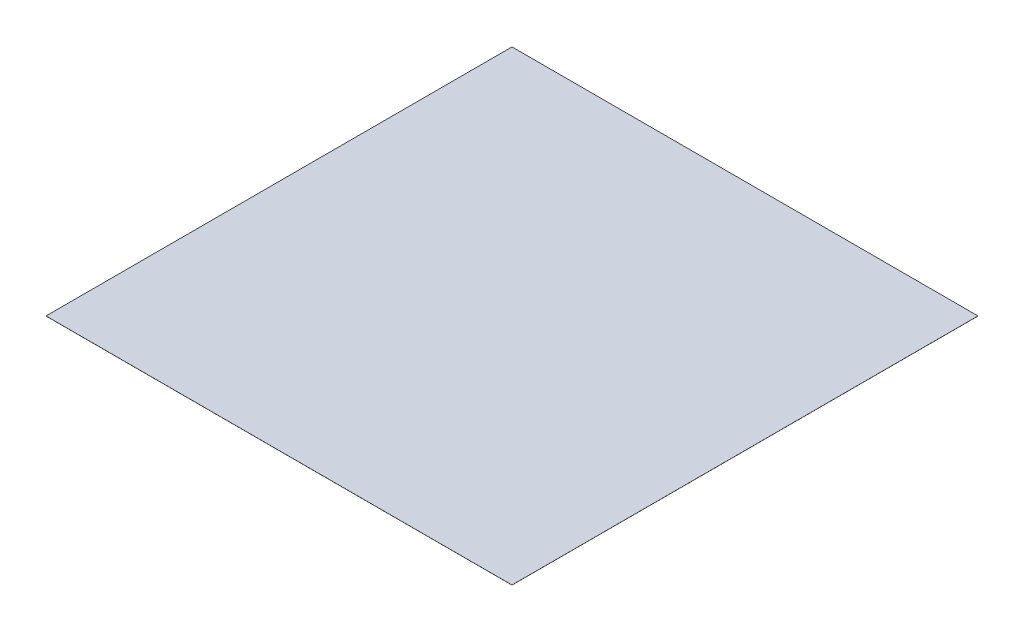
ISO-10303-21;
HEADER;
FILE_DESCRIPTION(('STEP AP214'),'2;1');
FILE_NAME('part.step','',(''),(''),'','','');
FILE_SCHEMA(('AUTOMOTIVE_DESIGN { 1 0 10303 214 1 1 1 1 }'));
ENDSEC;
DATA;
#1=APPLICATION_CONTEXT('core data for automotive mechanical design processes');
#2=APPLICATION_PROTOCOL_DEFINITION('international standard','automotive_design',2000,#1);
#3=PRODUCT_CONTEXT('',#1,'mechanical');
#4=PRODUCT('Part','Part','',(#3));
#5=PRODUCT_RELATED_PRODUCT_CATEGORY('part','',(#4));
#6=PRODUCT_DEFINITION_FORMATION('','',#4);
#7=PRODUCT_DEFINITION_CONTEXT('part definition',#1,'design');
#8=PRODUCT_DEFINITION('design','',#6,#7);
#9=PRODUCT_DEFINITION_SHAPE('','',#8);
#10=(LENGTH_UNIT() NAMED_UNIT(*) SI_UNIT(.MILLI.,.METRE.));
#11=(NAMED_UNIT(*) PLANE_ANGLE_UNIT() SI_UNIT($,.RADIAN.));
#12=(NAMED_UNIT(*) SI_UNIT($,.STERADIAN.) SOLID_ANGLE_UNIT());
#13=UNCERTAINTY_MEASURE_WITH_UNIT(LENGTH_MEASURE(1.E-05),#10,'distance_accuracy_value','');
#14=(GEOMETRIC_REPRESENTATION_CONTEXT(3) GLOBAL_UNCERTAINTY_ASSIGNED_CONTEXT((#13)) GLOBAL_UNIT_ASSIGNED_CONTEXT((#10,
#11,#12)) REPRESENTATION_CONTEXT('',''));
#15=CARTESIAN_POINT('',(0.,0.,0.));
#16=DIRECTION('',(0.,0.,1.));
#17=DIRECTION('',(1.,0.,0.));
#18=AXIS2_PLACEMENT_3D('',#15,#16,#17);
#19=CARTESIAN_POINT('',(0.,10.,0.));
#20=DIRECTION('',(1.,0.,0.));
#21=DIRECTION('',(0.,0.,-1.));
#22=AXIS2_PLACEMENT_3D('',#19,#20,#21);
#23=PLANE('',#22);
#24=DIRECTION('',(0.,0.,1.));
#25=VECTOR('',#24,1.);
#26=CARTESIAN_POINT('',(0.,0.,0.));
#27=LINE('',#26,#25);
#28=CARTESIAN_POINT('',(0.,0.,-50000.));
#29=VERTEX_POINT('',#28);
#30=CARTESIAN_POINT('',(0.,0.,0.));
#31=VERTEX_POINT('',#30);
#32=EDGE_CURVE('E99',#29,#31,#27,.T.);
#33=ORIENTED_EDGE('',*,*,#32,.T.);
#34=DIRECTION('',(0.,-1.,0.));
#35=VECTOR('',#34,1.);
#36=CARTESIAN_POINT('',(0.,10.,0.));
#37=LINE('',#36,#35);
#38=CARTESIAN_POINT('',(0.,10.,0.));
#39=VERTEX_POINT('',#38);
#40=EDGE_CURVE('E11',#39,#31,#37,.T.);
#41=ORIENTED_EDGE('',*,*,#40,.F.);
#42=DIRECTION('',(0.,0.,1.));
#43=VECTOR('',#42,1.);
#44=CARTESIAN_POINT('',(0.,10.,0.));
#45=LINE('',#44,#43);
#46=CARTESIAN_POINT('',(0.,10.,-50000.));
#47=VERTEX_POINT('',#46);
#48=EDGE_CURVE('E87',#47,#39,#45,.T.);
#49=ORIENTED_EDGE('',*,*,#48,.F.);
#50=DIRECTION('',(0.,-1.,0.));
#51=VECTOR('',#50,1.);
#52=CARTESIAN_POINT('',(0.,10.,-50000.));
#53=LINE('',#52,#51);
#54=EDGE_CURVE('E95',#47,#29,#53,.T.);
#55=ORIENTED_EDGE('',*,*,#54,.T.);
#56=EDGE_LOOP('',(#33,#41,#49,#55));
#57=FACE_BOUND('',#56,.T.);
#58=ADVANCED_FACE('F36',(#57),#23,.F.);
#59=CARTESIAN_POINT('',(0.,10.,0.));
#60=DIRECTION('',(0.,0.,-1.));
#61=DIRECTION('',(-1.,0.,0.));
#62=AXIS2_PLACEMENT_3D('',#59,#60,#61);
#63=PLANE('',#62);
#64=DIRECTION('',(1.,0.,0.));
#65=VECTOR('',#64,1.);
#66=CARTESIAN_POINT('',(0.,0.,0.));
#67=LINE('',#66,#65);
#68=CARTESIAN_POINT('',(50000.,0.,0.));
#69=VERTEX_POINT('',#68);
#70=EDGE_CURVE('E91',#31,#69,#67,.T.);
#71=ORIENTED_EDGE('',*,*,#70,.T.);
#72=DIRECTION('',(0.,-1.,0.));
#73=VECTOR('',#72,1.);
#74=CARTESIAN_POINT('',(50000.,10.,0.));
#75=LINE('',#74,#73);
#76=CARTESIAN_POINT('',(50000.,10.,0.));
#77=VERTEX_POINT('',#76);
#78=EDGE_CURVE('E44',#77,#69,#75,.T.);
#79=ORIENTED_EDGE('',*,*,#78,.F.);
#80=DIRECTION('',(1.,0.,0.));
#81=VECTOR('',#80,1.);
#82=CARTESIAN_POINT('',(0.,10.,0.));
#83=LINE('',#82,#81);
#84=EDGE_CURVE('E82',#39,#77,#83,.T.);
#85=ORIENTED_EDGE('',*,*,#84,.F.);
#86=ORIENTED_EDGE('',*,*,#40,.T.);
#87=EDGE_LOOP('',(#71,#79,#85,#86));
#88=FACE_BOUND('',#87,.T.);
#89=ADVANCED_FACE('F90',(#88),#63,.F.);
#90=CARTESIAN_POINT('',(50000.,10.,0.));
#91=DIRECTION('',(-1.,0.,0.));
#92=DIRECTION('',(0.,0.,1.));
#93=AXIS2_PLACEMENT_3D('',#90,#91,#92);
#94=PLANE('',#93);
#95=DIRECTION('',(0.,0.,-1.));
#96=VECTOR('',#95,1.);
#97=CARTESIAN_POINT('',(50000.,0.,0.));
#98=LINE('',#97,#96);
#99=CARTESIAN_POINT('',(50000.,0.,-50000.));
#100=VERTEX_POINT('',#99);
#101=EDGE_CURVE('E69',#69,#100,#98,.T.);
#102=ORIENTED_EDGE('',*,*,#101,.T.);
#103=DIRECTION('',(0.,-1.,0.));
#104=VECTOR('',#103,1.);
#105=CARTESIAN_POINT('',(50000.,10.,-50000.));
#106=LINE('',#105,#104);
#107=CARTESIAN_POINT('',(50000.,10.,-50000.));
#108=VERTEX_POINT('',#107);
#109=EDGE_CURVE('E92',#108,#100,#106,.T.);
#110=ORIENTED_EDGE('',*,*,#109,.F.);
#111=DIRECTION('',(0.,0.,-1.));
#112=VECTOR('',#111,1.);
#113=CARTESIAN_POINT('',(50000.,10.,0.));
#114=LINE('',#113,#112);
#115=EDGE_CURVE('E85',#77,#108,#114,.T.);
#116=ORIENTED_EDGE('',*,*,#115,.F.);
#117=ORIENTED_EDGE('',*,*,#78,.T.);
#118=EDGE_LOOP('',(#102,#110,#116,#117));
#119=FACE_BOUND('',#118,.T.);
#120=ADVANCED_FACE('F93',(#119),#94,.F.);
#121=CARTESIAN_POINT('',(0.,10.,-50000.));
#122=DIRECTION('',(0.,0.,1.));
#123=DIRECTION('',(1.,0.,0.));
#124=AXIS2_PLACEMENT_3D('',#121,#122,#123);
#125=PLANE('',#124);
#126=DIRECTION('',(-1.,0.,0.));
#127=VECTOR('',#126,1.);
#128=CARTESIAN_POINT('',(0.,0.,-50000.));
#129=LINE('',#128,#127);
#130=EDGE_CURVE('E75',#100,#29,#129,.T.);
#131=ORIENTED_EDGE('',*,*,#130,.T.);
#132=ORIENTED_EDGE('',*,*,#54,.F.);
#133=DIRECTION('',(-1.,0.,0.));
#134=VECTOR('',#133,1.);
#135=CARTESIAN_POINT('',(0.,10.,-50000.));
#136=LINE('',#135,#134);
#137=EDGE_CURVE('E52',#108,#47,#136,.T.);
#138=ORIENTED_EDGE('',*,*,#137,.F.);
#139=ORIENTED_EDGE('',*,*,#109,.T.);
#140=EDGE_LOOP('',(#131,#132,#138,#139));
#141=FACE_BOUND('',#140,.T.);
#142=ADVANCED_FACE('F106',(#141),#125,.F.);
#143=CARTESIAN_POINT('',(0.,10.,0.));
#144=DIRECTION('',(0.,-1.,0.));
#145=DIRECTION('',(0.,0.,-1.));
#146=AXIS2_PLACEMENT_3D('',#143,#144,#145);
#147=PLANE('',#146);
#148=ORIENTED_EDGE('',*,*,#48,.T.);
#149=ORIENTED_EDGE('',*,*,#84,.T.);
#150=ORIENTED_EDGE('',*,*,#115,.T.);
#151=ORIENTED_EDGE('',*,*,#137,.T.);
#152=EDGE_LOOP('',(#148,#149,#150,#151));
#153=FACE_BOUND('',#152,.T.);
#154=ADVANCED_FACE('F83',(#153),#147,.F.);
#155=CARTESIAN_POINT('',(0.,0.,0.));
#156=DIRECTION('',(0.,-1.,0.));
#157=DIRECTION('',(0.,0.,-1.));
#158=AXIS2_PLACEMENT_3D('',#155,#156,#157);
#159=PLANE('',#158);
#160=ORIENTED_EDGE('',*,*,#32,.F.);
#161=ORIENTED_EDGE('',*,*,#130,.F.);
#162=ORIENTED_EDGE('',*,*,#101,.F.);
#163=ORIENTED_EDGE('',*,*,#70,.F.);
#164=EDGE_LOOP('',(#160,#161,#162,#163));
#165=FACE_BOUND('',#164,.T.);
#166=ADVANCED_FACE('F109',(#165),#159,.T.);
#167=CLOSED_SHELL('',(#58,#89,#120,#142,#154,#166));
#168=MANIFOLD_SOLID_BREP('B2',#167);
#169=ADVANCED_BREP_SHAPE_REPRESENTATION('',(#18,#168),#14);
#170=SHAPE_DEFINITION_REPRESENTATION(#9,#169);
ENDSEC;
END-ISO-10303-21;
